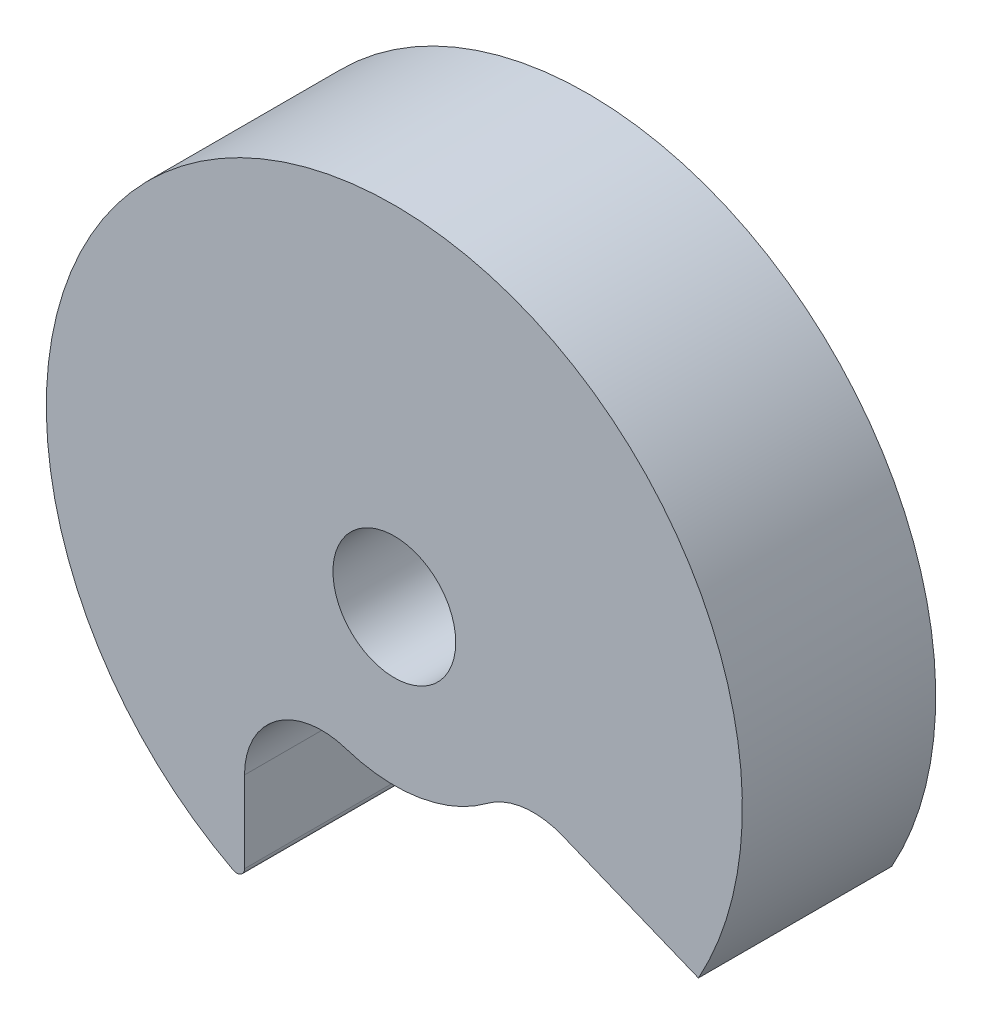
ISO-10303-21;
HEADER;
FILE_DESCRIPTION(('STEP AP214'),'2;1');
FILE_NAME('part.step','',(''),(''),'','','');
FILE_SCHEMA(('AUTOMOTIVE_DESIGN { 1 0 10303 214 1 1 1 1 }'));
ENDSEC;
DATA;
#1=APPLICATION_CONTEXT('core data for automotive mechanical design processes');
#2=APPLICATION_PROTOCOL_DEFINITION('international standard','automotive_design',2000,#1);
#3=PRODUCT_CONTEXT('',#1,'mechanical');
#4=PRODUCT('Part','Part','',(#3));
#5=PRODUCT_RELATED_PRODUCT_CATEGORY('part','',(#4));
#6=PRODUCT_DEFINITION_FORMATION('','',#4);
#7=PRODUCT_DEFINITION_CONTEXT('part definition',#1,'design');
#8=PRODUCT_DEFINITION('design','',#6,#7);
#9=PRODUCT_DEFINITION_SHAPE('','',#8);
#10=(LENGTH_UNIT() NAMED_UNIT(*) SI_UNIT(.MILLI.,.METRE.));
#11=(NAMED_UNIT(*) PLANE_ANGLE_UNIT() SI_UNIT($,.RADIAN.));
#12=(NAMED_UNIT(*) SI_UNIT($,.STERADIAN.) SOLID_ANGLE_UNIT());
#13=UNCERTAINTY_MEASURE_WITH_UNIT(LENGTH_MEASURE(1.E-05),#10,'distance_accuracy_value','');
#14=(GEOMETRIC_REPRESENTATION_CONTEXT(3) GLOBAL_UNCERTAINTY_ASSIGNED_CONTEXT((#13)) GLOBAL_UNIT_ASSIGNED_CONTEXT((#10,
#11,#12)) REPRESENTATION_CONTEXT('',''));
#15=CARTESIAN_POINT('',(0.,0.,0.));
#16=DIRECTION('',(0.,0.,1.));
#17=DIRECTION('',(1.,0.,0.));
#18=AXIS2_PLACEMENT_3D('',#15,#16,#17);
#19=CARTESIAN_POINT('',(-0.284627083573393,9.3309330408921,5.));
#20=DIRECTION('',(0.,0.,-1.));
#21=DIRECTION('',(-1.,0.,0.));
#22=AXIS2_PLACEMENT_3D('',#19,#20,#21);
#23=CYLINDRICAL_SURFACE('',#22,1.5875);
#24=CARTESIAN_POINT('',(-0.284627083573393,9.3309330408921,5.));
#25=DIRECTION('',(0.,0.,1.));
#26=DIRECTION('',(1.,0.,0.));
#27=AXIS2_PLACEMENT_3D('',#24,#25,#26);
#28=CIRCLE('',#27,1.5875);
#29=CARTESIAN_POINT('',(1.30287291642661,9.3309330408921,5.));
#30=VERTEX_POINT('',#29);
#31=EDGE_CURVE('E119',#30,#30,#28,.T.);
#32=ORIENTED_EDGE('',*,*,#31,.T.);
#33=EDGE_LOOP('',(#32));
#34=FACE_BOUND('',#33,.T.);
#35=CARTESIAN_POINT('',(-0.284627083573393,9.3309330408921,0.));
#36=DIRECTION('',(0.,0.,1.));
#37=DIRECTION('',(1.,0.,0.));
#38=AXIS2_PLACEMENT_3D('',#35,#36,#37);
#39=CIRCLE('',#38,1.5875);
#40=CARTESIAN_POINT('',(1.30287291642661,9.3309330408921,0.));
#41=VERTEX_POINT('',#40);
#42=EDGE_CURVE('E120',#41,#41,#39,.T.);
#43=ORIENTED_EDGE('',*,*,#42,.F.);
#44=EDGE_LOOP('',(#43));
#45=FACE_BOUND('',#44,.T.);
#46=ADVANCED_FACE('F35',(#34,#45),#23,.F.);
#47=CARTESIAN_POINT('',(-0.284627083573393,9.3309330408921,5.));
#48=DIRECTION('',(0.,0.,-1.));
#49=DIRECTION('',(-1.,0.,0.));
#50=AXIS2_PLACEMENT_3D('',#47,#48,#49);
#51=CYLINDRICAL_SURFACE('',#50,9.);
#52=CARTESIAN_POINT('',(-0.284627083573393,9.3309330408921,0.));
#53=DIRECTION('',(0.,0.,1.));
#54=DIRECTION('',(1.,0.,0.));
#55=AXIS2_PLACEMENT_3D('',#52,#53,#54);
#56=CIRCLE('',#55,9.);
#57=CARTESIAN_POINT('',(7.57850813598148,4.95245105292004,0.));
#58=VERTEX_POINT('',#57);
#59=CARTESIAN_POINT('',(-4.45141609380015,1.35359831403918,0.));
#60=VERTEX_POINT('',#59);
#61=EDGE_CURVE('E112',#58,#60,#56,.T.);
#62=ORIENTED_EDGE('',*,*,#61,.T.);
#63=DIRECTION('',(0.,0.,-1.));
#64=VECTOR('',#63,1.);
#65=CARTESIAN_POINT('',(-4.45141609380015,1.35359831403918,5.));
#66=LINE('',#65,#64);
#67=CARTESIAN_POINT('',(-4.45141609380015,1.35359831403918,5.));
#68=VERTEX_POINT('',#67);
#69=EDGE_CURVE('E129',#60,#68,#66,.F.);
#70=ORIENTED_EDGE('',*,*,#69,.T.);
#71=CARTESIAN_POINT('',(-0.284627083573393,9.3309330408921,5.));
#72=DIRECTION('',(0.,0.,1.));
#73=DIRECTION('',(1.,0.,0.));
#74=AXIS2_PLACEMENT_3D('',#71,#72,#73);
#75=CIRCLE('',#74,9.);
#76=CARTESIAN_POINT('',(7.57850813598148,4.95245105292004,5.));
#77=VERTEX_POINT('',#76);
#78=EDGE_CURVE('E114',#77,#68,#75,.T.);
#79=ORIENTED_EDGE('',*,*,#78,.F.);
#80=DIRECTION('',(0.,0.,1.));
#81=VECTOR('',#80,1.);
#82=CARTESIAN_POINT('',(7.57850813598148,4.95245105292004,0.));
#83=LINE('',#82,#81);
#84=EDGE_CURVE('E98',#58,#77,#83,.T.);
#85=ORIENTED_EDGE('',*,*,#84,.F.);
#86=EDGE_LOOP('',(#62,#70,#79,#85));
#87=FACE_BOUND('',#86,.T.);
#88=ADVANCED_FACE('F110',(#87),#51,.T.);
#89=CARTESIAN_POINT('',(0.,0.,5.));
#90=DIRECTION('',(0.,0.,1.));
#91=DIRECTION('',(1.,0.,0.));
#92=AXIS2_PLACEMENT_3D('',#89,#90,#91);
#93=PLANE('',#92);
#94=ORIENTED_EDGE('',*,*,#78,.T.);
#95=CARTESIAN_POINT('',(-4.35882078246178,1.53087241908036,5.));
#96=DIRECTION('',(0.,0.,1.));
#97=DIRECTION('',(1.,0.,0.));
#98=AXIS2_PLACEMENT_3D('',#95,#96,#97);
#99=CIRCLE('',#98,0.2);
#100=CARTESIAN_POINT('',(-4.15882078246178,1.53087241908036,5.));
#101=VERTEX_POINT('',#100);
#102=EDGE_CURVE('E57',#68,#101,#99,.T.);
#103=ORIENTED_EDGE('',*,*,#102,.T.);
#104=DIRECTION('',(0.,-1.,0.));
#105=VECTOR('',#104,1.);
#106=CARTESIAN_POINT('',(-4.15882078246178,1.2074717599175,5.));
#107=LINE('',#106,#105);
#108=CARTESIAN_POINT('',(-4.15882078246178,3.6311612929142,5.));
#109=VERTEX_POINT('',#108);
#110=EDGE_CURVE('E105',#109,#101,#107,.T.);
#111=ORIENTED_EDGE('',*,*,#110,.F.);
#112=CARTESIAN_POINT('',(-2.15882078246178,3.6311612929142,5.));
#113=DIRECTION('',(0.,0.,1.));
#114=DIRECTION('',(-1.,0.,0.));
#115=AXIS2_PLACEMENT_3D('',#112,#113,#114);
#116=CIRCLE('',#115,2.);
#117=CARTESIAN_POINT('',(-1.53408954949898,5.53108520890683,5.));
#118=VERTEX_POINT('',#117);
#119=EDGE_CURVE('E139',#118,#109,#116,.T.);
#120=ORIENTED_EDGE('',*,*,#119,.F.);
#121=CARTESIAN_POINT('',(-0.284627083573393,9.3309330408921,5.));
#122=DIRECTION('',(0.,0.,-1.));
#123=DIRECTION('',(1.,0.,0.));
#124=AXIS2_PLACEMENT_3D('',#121,#122,#123);
#125=CIRCLE('',#124,4.);
#126=CARTESIAN_POINT('',(2.1125943211182,6.12885097809476,5.));
#127=VERTEX_POINT('',#126);
#128=EDGE_CURVE('E142',#127,#118,#125,.T.);
#129=ORIENTED_EDGE('',*,*,#128,.F.);
#130=CARTESIAN_POINT('',(3.31120502346399,4.52780994669609,5.));
#131=DIRECTION('',(0.,0.,1.));
#132=DIRECTION('',(1.,0.,0.));
#133=AXIS2_PLACEMENT_3D('',#130,#131,#132);
#134=CIRCLE('',#133,2.);
#135=CARTESIAN_POINT('',(4.06418831938993,6.38064997110632,5.));
#136=VERTEX_POINT('',#135);
#137=EDGE_CURVE('E145',#136,#127,#134,.T.);
#138=ORIENTED_EDGE('',*,*,#137,.F.);
#139=DIRECTION('',(-0.926420012205117,0.376491647962967,0.));
#140=VECTOR('',#139,1.);
#141=CARTESIAN_POINT('',(7.57850813598148,4.95245105292004,5.));
#142=LINE('',#141,#140);
#143=EDGE_CURVE('E148',#77,#136,#142,.T.);
#144=ORIENTED_EDGE('',*,*,#143,.F.);
#145=EDGE_LOOP('',(#94,#103,#111,#120,#129,#138,#144));
#146=FACE_BOUND('',#145,.T.);
#147=ORIENTED_EDGE('',*,*,#31,.F.);
#148=EDGE_LOOP('',(#147));
#149=FACE_BOUND('',#148,.T.);
#150=ADVANCED_FACE('F179',(#146,#149),#93,.T.);
#151=CARTESIAN_POINT('',(0.,0.,0.));
#152=DIRECTION('',(0.,0.,1.));
#153=DIRECTION('',(1.,0.,0.));
#154=AXIS2_PLACEMENT_3D('',#151,#152,#153);
#155=PLANE('',#154);
#156=ORIENTED_EDGE('',*,*,#42,.T.);
#157=EDGE_LOOP('',(#156));
#158=FACE_BOUND('',#157,.T.);
#159=DIRECTION('',(0.,-1.,0.));
#160=VECTOR('',#159,1.);
#161=CARTESIAN_POINT('',(-4.15882078246178,1.2074717599175,0.));
#162=LINE('',#161,#160);
#163=CARTESIAN_POINT('',(-4.15882078246178,3.6311612929142,0.));
#164=VERTEX_POINT('',#163);
#165=CARTESIAN_POINT('',(-4.15882078246178,1.53087241908036,0.));
#166=VERTEX_POINT('',#165);
#167=EDGE_CURVE('E115',#164,#166,#162,.T.);
#168=ORIENTED_EDGE('',*,*,#167,.T.);
#169=CARTESIAN_POINT('',(-4.35882078246178,1.53087241908036,0.));
#170=DIRECTION('',(0.,0.,1.));
#171=DIRECTION('',(1.,0.,0.));
#172=AXIS2_PLACEMENT_3D('',#169,#170,#171);
#173=CIRCLE('',#172,0.2);
#174=EDGE_CURVE('E11',#166,#60,#173,.F.);
#175=ORIENTED_EDGE('',*,*,#174,.T.);
#176=ORIENTED_EDGE('',*,*,#61,.F.);
#177=DIRECTION('',(-0.926420012205117,0.376491647962967,0.));
#178=VECTOR('',#177,1.);
#179=CARTESIAN_POINT('',(7.57850813598148,4.95245105292004,0.));
#180=LINE('',#179,#178);
#181=CARTESIAN_POINT('',(4.06418831938993,6.38064997110632,0.));
#182=VERTEX_POINT('',#181);
#183=EDGE_CURVE('E94',#58,#182,#180,.T.);
#184=ORIENTED_EDGE('',*,*,#183,.T.);
#185=CARTESIAN_POINT('',(3.31120502346399,4.52780994669609,0.));
#186=DIRECTION('',(0.,0.,1.));
#187=DIRECTION('',(1.,0.,0.));
#188=AXIS2_PLACEMENT_3D('',#185,#186,#187);
#189=CIRCLE('',#188,2.);
#190=CARTESIAN_POINT('',(2.1125943211182,6.12885097809476,0.));
#191=VERTEX_POINT('',#190);
#192=EDGE_CURVE('E104',#182,#191,#189,.T.);
#193=ORIENTED_EDGE('',*,*,#192,.T.);
#194=CARTESIAN_POINT('',(-0.284627083573393,9.3309330408921,0.));
#195=DIRECTION('',(0.,0.,-1.));
#196=DIRECTION('',(1.,0.,0.));
#197=AXIS2_PLACEMENT_3D('',#194,#195,#196);
#198=CIRCLE('',#197,4.);
#199=CARTESIAN_POINT('',(-1.53408954949898,5.53108520890683,0.));
#200=VERTEX_POINT('',#199);
#201=EDGE_CURVE('E154',#191,#200,#198,.T.);
#202=ORIENTED_EDGE('',*,*,#201,.T.);
#203=CARTESIAN_POINT('',(-2.15882078246178,3.6311612929142,0.));
#204=DIRECTION('',(0.,0.,1.));
#205=DIRECTION('',(-1.,0.,0.));
#206=AXIS2_PLACEMENT_3D('',#203,#204,#205);
#207=CIRCLE('',#206,2.);
#208=EDGE_CURVE('E151',#200,#164,#207,.T.);
#209=ORIENTED_EDGE('',*,*,#208,.T.);
#210=EDGE_LOOP('',(#168,#175,#176,#184,#193,#202,#209));
#211=FACE_BOUND('',#210,.T.);
#212=ADVANCED_FACE('F117',(#158,#211),#155,.F.);
#213=CARTESIAN_POINT('',(-4.15882078246178,1.2074717599175,0.));
#214=DIRECTION('',(-1.,0.,0.));
#215=DIRECTION('',(0.,0.,1.));
#216=AXIS2_PLACEMENT_3D('',#213,#214,#215);
#217=PLANE('',#216);
#218=ORIENTED_EDGE('',*,*,#110,.T.);
#219=DIRECTION('',(0.,0.,-1.));
#220=VECTOR('',#219,1.);
#221=CARTESIAN_POINT('',(-4.15882078246178,1.53087241908036,0.));
#222=LINE('',#221,#220);
#223=EDGE_CURVE('E43',#101,#166,#222,.T.);
#224=ORIENTED_EDGE('',*,*,#223,.T.);
#225=ORIENTED_EDGE('',*,*,#167,.F.);
#226=DIRECTION('',(0.,0.,1.));
#227=VECTOR('',#226,1.);
#228=CARTESIAN_POINT('',(-4.15882078246178,3.6311612929142,0.));
#229=LINE('',#228,#227);
#230=EDGE_CURVE('E125',#164,#109,#229,.T.);
#231=ORIENTED_EDGE('',*,*,#230,.T.);
#232=EDGE_LOOP('',(#218,#224,#225,#231));
#233=FACE_BOUND('',#232,.T.);
#234=ADVANCED_FACE('F185',(#233),#217,.F.);
#235=CARTESIAN_POINT('',(-2.15882078246178,3.6311612929142,0.));
#236=DIRECTION('',(0.,0.,1.));
#237=DIRECTION('',(1.,0.,0.));
#238=AXIS2_PLACEMENT_3D('',#235,#236,#237);
#239=CYLINDRICAL_SURFACE('',#238,2.);
#240=ORIENTED_EDGE('',*,*,#119,.T.);
#241=ORIENTED_EDGE('',*,*,#230,.F.);
#242=ORIENTED_EDGE('',*,*,#208,.F.);
#243=DIRECTION('',(0.,0.,1.));
#244=VECTOR('',#243,1.);
#245=CARTESIAN_POINT('',(-1.53408954949898,5.53108520890683,0.));
#246=LINE('',#245,#244);
#247=EDGE_CURVE('E135',#200,#118,#246,.T.);
#248=ORIENTED_EDGE('',*,*,#247,.T.);
#249=EDGE_LOOP('',(#240,#241,#242,#248));
#250=FACE_BOUND('',#249,.T.);
#251=ADVANCED_FACE('F167',(#250),#239,.F.);
#252=CARTESIAN_POINT('',(-0.284627083573393,9.3309330408921,0.));
#253=DIRECTION('',(0.,0.,1.));
#254=DIRECTION('',(1.,0.,0.));
#255=AXIS2_PLACEMENT_3D('',#252,#253,#254);
#256=CYLINDRICAL_SURFACE('',#255,4.);
#257=ORIENTED_EDGE('',*,*,#128,.T.);
#258=ORIENTED_EDGE('',*,*,#247,.F.);
#259=ORIENTED_EDGE('',*,*,#201,.F.);
#260=DIRECTION('',(0.,0.,1.));
#261=VECTOR('',#260,1.);
#262=CARTESIAN_POINT('',(2.1125943211182,6.12885097809476,0.));
#263=LINE('',#262,#261);
#264=EDGE_CURVE('E133',#191,#127,#263,.T.);
#265=ORIENTED_EDGE('',*,*,#264,.T.);
#266=EDGE_LOOP('',(#257,#258,#259,#265));
#267=FACE_BOUND('',#266,.T.);
#268=ADVANCED_FACE('F163',(#267),#256,.T.);
#269=CARTESIAN_POINT('',(3.31120502346399,4.52780994669609,0.));
#270=DIRECTION('',(0.,0.,1.));
#271=DIRECTION('',(1.,0.,0.));
#272=AXIS2_PLACEMENT_3D('',#269,#270,#271);
#273=CYLINDRICAL_SURFACE('',#272,2.);
#274=ORIENTED_EDGE('',*,*,#137,.T.);
#275=ORIENTED_EDGE('',*,*,#264,.F.);
#276=ORIENTED_EDGE('',*,*,#192,.F.);
#277=DIRECTION('',(0.,0.,1.));
#278=VECTOR('',#277,1.);
#279=CARTESIAN_POINT('',(4.06418831938993,6.38064997110632,0.));
#280=LINE('',#279,#278);
#281=EDGE_CURVE('E100',#182,#136,#280,.T.);
#282=ORIENTED_EDGE('',*,*,#281,.T.);
#283=EDGE_LOOP('',(#274,#275,#276,#282));
#284=FACE_BOUND('',#283,.T.);
#285=ADVANCED_FACE('F159',(#284),#273,.F.);
#286=CARTESIAN_POINT('',(7.57850813598148,4.95245105292004,0.));
#287=DIRECTION('',(0.376491647962967,0.926420012205117,0.));
#288=DIRECTION('',(-0.926420012205117,0.376491647962967,0.));
#289=AXIS2_PLACEMENT_3D('',#286,#287,#288);
#290=PLANE('',#289);
#291=ORIENTED_EDGE('',*,*,#143,.T.);
#292=ORIENTED_EDGE('',*,*,#281,.F.);
#293=ORIENTED_EDGE('',*,*,#183,.F.);
#294=ORIENTED_EDGE('',*,*,#84,.T.);
#295=EDGE_LOOP('',(#291,#292,#293,#294));
#296=FACE_BOUND('',#295,.T.);
#297=ADVANCED_FACE('F97',(#296),#290,.F.);
#298=CARTESIAN_POINT('',(-4.35882078246178,1.53087241908036,5.));
#299=DIRECTION('',(0.,0.,-1.));
#300=DIRECTION('',(-1.,0.,0.));
#301=AXIS2_PLACEMENT_3D('',#298,#299,#300);
#302=CYLINDRICAL_SURFACE('',#301,0.2);
#303=ORIENTED_EDGE('',*,*,#174,.F.);
#304=ORIENTED_EDGE('',*,*,#223,.F.);
#305=ORIENTED_EDGE('',*,*,#102,.F.);
#306=ORIENTED_EDGE('',*,*,#69,.F.);
#307=EDGE_LOOP('',(#303,#304,#305,#306));
#308=FACE_BOUND('',#307,.T.);
#309=ADVANCED_FACE('F37',(#308),#302,.T.);
#310=CLOSED_SHELL('',(#46,#88,#150,#212,#234,#251,#268,#285,#297,#309));
#311=MANIFOLD_SOLID_BREP('B2',#310);
#312=ADVANCED_BREP_SHAPE_REPRESENTATION('',(#18,#311),#14);
#313=SHAPE_DEFINITION_REPRESENTATION(#9,#312);
ENDSEC;
END-ISO-10303-21;
